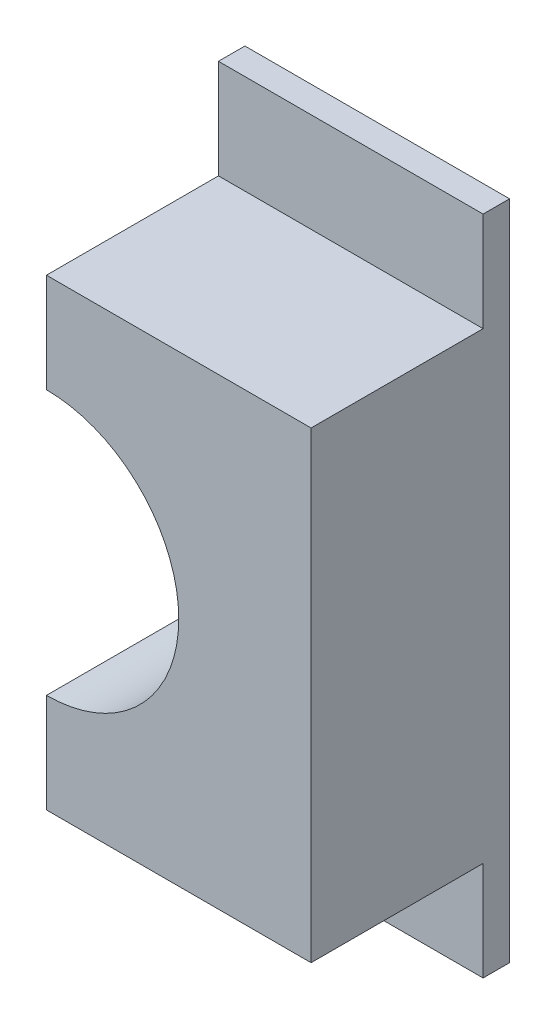
ISO-10303-21;
HEADER;
FILE_DESCRIPTION(('STEP AP214'),'2;1');
FILE_NAME('part.step','',(''),(''),'','','');
FILE_SCHEMA(('AUTOMOTIVE_DESIGN { 1 0 10303 214 1 1 1 1 }'));
ENDSEC;
DATA;
#1=APPLICATION_CONTEXT('core data for automotive mechanical design processes');
#2=APPLICATION_PROTOCOL_DEFINITION('international standard','automotive_design',2000,#1);
#3=PRODUCT_CONTEXT('',#1,'mechanical');
#4=PRODUCT('Part','Part','',(#3));
#5=PRODUCT_RELATED_PRODUCT_CATEGORY('part','',(#4));
#6=PRODUCT_DEFINITION_FORMATION('','',#4);
#7=PRODUCT_DEFINITION_CONTEXT('part definition',#1,'design');
#8=PRODUCT_DEFINITION('design','',#6,#7);
#9=PRODUCT_DEFINITION_SHAPE('','',#8);
#10=(LENGTH_UNIT() NAMED_UNIT(*) SI_UNIT(.MILLI.,.METRE.));
#11=(NAMED_UNIT(*) PLANE_ANGLE_UNIT() SI_UNIT($,.RADIAN.));
#12=(NAMED_UNIT(*) SI_UNIT($,.STERADIAN.) SOLID_ANGLE_UNIT());
#13=UNCERTAINTY_MEASURE_WITH_UNIT(LENGTH_MEASURE(1.E-05),#10,'distance_accuracy_value','');
#14=(GEOMETRIC_REPRESENTATION_CONTEXT(3) GLOBAL_UNCERTAINTY_ASSIGNED_CONTEXT((#13)) GLOBAL_UNIT_ASSIGNED_CONTEXT((#10,
#11,#12)) REPRESENTATION_CONTEXT('',''));
#15=CARTESIAN_POINT('',(0.,0.,0.));
#16=DIRECTION('',(0.,0.,1.));
#17=DIRECTION('',(1.,0.,0.));
#18=AXIS2_PLACEMENT_3D('',#15,#16,#17);
#19=CARTESIAN_POINT('',(-0.2,-0.5,0.04));
#20=DIRECTION('',(0.,0.,1.));
#21=DIRECTION('',(1.,0.,0.));
#22=AXIS2_PLACEMENT_3D('',#19,#20,#21);
#23=PLANE('',#22);
#24=DIRECTION('',(1.,0.,0.));
#25=VECTOR('',#24,1.);
#26=CARTESIAN_POINT('',(0.2,0.5,0.04));
#27=LINE('',#26,#25);
#28=CARTESIAN_POINT('',(0.2,0.5,0.04));
#29=VERTEX_POINT('',#28);
#30=CARTESIAN_POINT('',(-0.2,0.5,0.04));
#31=VERTEX_POINT('',#30);
#32=EDGE_CURVE('E157',#29,#31,#27,.F.);
#33=ORIENTED_EDGE('',*,*,#32,.T.);
#34=DIRECTION('',(0.,1.,0.));
#35=VECTOR('',#34,1.);
#36=CARTESIAN_POINT('',(-0.2,0.35,0.04));
#37=LINE('',#36,#35);
#38=CARTESIAN_POINT('',(-0.2,0.35,0.04));
#39=VERTEX_POINT('',#38);
#40=EDGE_CURVE('E147',#31,#39,#37,.F.);
#41=ORIENTED_EDGE('',*,*,#40,.T.);
#42=DIRECTION('',(1.,0.,0.));
#43=VECTOR('',#42,1.);
#44=CARTESIAN_POINT('',(0.2,0.35,0.04));
#45=LINE('',#44,#43);
#46=CARTESIAN_POINT('',(0.2,0.35,0.04));
#47=VERTEX_POINT('',#46);
#48=EDGE_CURVE('E81',#39,#47,#45,.T.);
#49=ORIENTED_EDGE('',*,*,#48,.T.);
#50=DIRECTION('',(0.,1.,0.));
#51=VECTOR('',#50,1.);
#52=CARTESIAN_POINT('',(0.2,-0.35,0.04));
#53=LINE('',#52,#51);
#54=EDGE_CURVE('E162',#47,#29,#53,.T.);
#55=ORIENTED_EDGE('',*,*,#54,.T.);
#56=EDGE_LOOP('',(#33,#41,#49,#55));
#57=FACE_BOUND('',#56,.T.);
#58=ADVANCED_FACE('F17',(#57),#23,.T.);
#59=CARTESIAN_POINT('',(0.2,0.35,0.3));
#60=DIRECTION('',(0.,-1.,0.));
#61=DIRECTION('',(0.,0.,-1.));
#62=AXIS2_PLACEMENT_3D('',#59,#60,#61);
#63=PLANE('',#62);
#64=ORIENTED_EDGE('',*,*,#48,.F.);
#65=DIRECTION('',(0.,0.,-1.));
#66=VECTOR('',#65,1.);
#67=CARTESIAN_POINT('',(-0.2,0.35,0.3));
#68=LINE('',#67,#66);
#69=CARTESIAN_POINT('',(-0.2,0.35,0.3));
#70=VERTEX_POINT('',#69);
#71=EDGE_CURVE('E139',#39,#70,#68,.F.);
#72=ORIENTED_EDGE('',*,*,#71,.T.);
#73=DIRECTION('',(1.,0.,0.));
#74=VECTOR('',#73,1.);
#75=CARTESIAN_POINT('',(-0.2,0.35,0.3));
#76=LINE('',#75,#74);
#77=CARTESIAN_POINT('',(0.2,0.35,0.3));
#78=VERTEX_POINT('',#77);
#79=EDGE_CURVE('E57',#78,#70,#76,.F.);
#80=ORIENTED_EDGE('',*,*,#79,.F.);
#81=DIRECTION('',(0.,0.,1.));
#82=VECTOR('',#81,1.);
#83=CARTESIAN_POINT('',(0.2,0.35,0.3));
#84=LINE('',#83,#82);
#85=EDGE_CURVE('E164',#78,#47,#84,.F.);
#86=ORIENTED_EDGE('',*,*,#85,.T.);
#87=EDGE_LOOP('',(#64,#72,#80,#86));
#88=FACE_BOUND('',#87,.T.);
#89=ADVANCED_FACE('F246',(#88),#63,.F.);
#90=CARTESIAN_POINT('',(-0.2,-0.35,0.3));
#91=DIRECTION('',(0.,1.,0.));
#92=DIRECTION('',(0.,0.,1.));
#93=AXIS2_PLACEMENT_3D('',#90,#91,#92);
#94=PLANE('',#93);
#95=DIRECTION('',(1.,0.,0.));
#96=VECTOR('',#95,1.);
#97=CARTESIAN_POINT('',(-0.2,-0.35,0.04));
#98=LINE('',#97,#96);
#99=CARTESIAN_POINT('',(0.2,-0.35,0.04));
#100=VERTEX_POINT('',#99);
#101=CARTESIAN_POINT('',(-0.2,-0.35,0.04));
#102=VERTEX_POINT('',#101);
#103=EDGE_CURVE('E124',#100,#102,#98,.F.);
#104=ORIENTED_EDGE('',*,*,#103,.F.);
#105=DIRECTION('',(0.,0.,1.));
#106=VECTOR('',#105,1.);
#107=CARTESIAN_POINT('',(0.2,-0.35,0.3));
#108=LINE('',#107,#106);
#109=CARTESIAN_POINT('',(0.2,-0.35,0.3));
#110=VERTEX_POINT('',#109);
#111=EDGE_CURVE('E169',#100,#110,#108,.T.);
#112=ORIENTED_EDGE('',*,*,#111,.T.);
#113=DIRECTION('',(1.,0.,0.));
#114=VECTOR('',#113,1.);
#115=CARTESIAN_POINT('',(-0.2,-0.35,0.3));
#116=LINE('',#115,#114);
#117=CARTESIAN_POINT('',(-0.2,-0.35,0.3));
#118=VERTEX_POINT('',#117);
#119=EDGE_CURVE('E134',#118,#110,#116,.T.);
#120=ORIENTED_EDGE('',*,*,#119,.F.);
#121=DIRECTION('',(0.,0.,-1.));
#122=VECTOR('',#121,1.);
#123=CARTESIAN_POINT('',(-0.2,-0.35,0.3));
#124=LINE('',#123,#122);
#125=EDGE_CURVE('E125',#118,#102,#124,.T.);
#126=ORIENTED_EDGE('',*,*,#125,.T.);
#127=EDGE_LOOP('',(#104,#112,#120,#126));
#128=FACE_BOUND('',#127,.T.);
#129=ADVANCED_FACE('F240',(#128),#94,.F.);
#130=CARTESIAN_POINT('',(-0.2,-0.5,0.04));
#131=DIRECTION('',(0.,0.,1.));
#132=DIRECTION('',(1.,0.,0.));
#133=AXIS2_PLACEMENT_3D('',#130,#131,#132);
#134=PLANE('',#133);
#135=DIRECTION('',(1.,0.,0.));
#136=VECTOR('',#135,1.);
#137=CARTESIAN_POINT('',(-0.2,-0.5,0.04));
#138=LINE('',#137,#136);
#139=CARTESIAN_POINT('',(-0.2,-0.5,0.04));
#140=VERTEX_POINT('',#139);
#141=CARTESIAN_POINT('',(0.2,-0.5,0.04));
#142=VERTEX_POINT('',#141);
#143=EDGE_CURVE('E88',#140,#142,#138,.T.);
#144=ORIENTED_EDGE('',*,*,#143,.T.);
#145=DIRECTION('',(0.,1.,0.));
#146=VECTOR('',#145,1.);
#147=CARTESIAN_POINT('',(0.2,-0.35,0.04));
#148=LINE('',#147,#146);
#149=EDGE_CURVE('E167',#142,#100,#148,.T.);
#150=ORIENTED_EDGE('',*,*,#149,.T.);
#151=ORIENTED_EDGE('',*,*,#103,.T.);
#152=DIRECTION('',(0.,1.,0.));
#153=VECTOR('',#152,1.);
#154=CARTESIAN_POINT('',(-0.2,0.35,0.04));
#155=LINE('',#154,#153);
#156=EDGE_CURVE('E120',#102,#140,#155,.F.);
#157=ORIENTED_EDGE('',*,*,#156,.T.);
#158=EDGE_LOOP('',(#144,#150,#151,#157));
#159=FACE_BOUND('',#158,.T.);
#160=ADVANCED_FACE('F123',(#159),#134,.T.);
#161=CARTESIAN_POINT('',(-0.2,-0.35,0.3));
#162=DIRECTION('',(0.,0.,1.));
#163=DIRECTION('',(1.,0.,0.));
#164=AXIS2_PLACEMENT_3D('',#161,#162,#163);
#165=PLANE('',#164);
#166=ORIENTED_EDGE('',*,*,#79,.T.);
#167=DIRECTION('',(0.,1.,0.));
#168=VECTOR('',#167,1.);
#169=CARTESIAN_POINT('',(-0.2,0.35,0.3));
#170=LINE('',#169,#168);
#171=CARTESIAN_POINT('',(-0.2,0.2,0.3));
#172=VERTEX_POINT('',#171);
#173=EDGE_CURVE('E48',#70,#172,#170,.F.);
#174=ORIENTED_EDGE('',*,*,#173,.T.);
#175=CARTESIAN_POINT('',(-0.2,0.,0.3));
#176=DIRECTION('',(0.,0.,1.));
#177=DIRECTION('',(1.,0.,0.));
#178=AXIS2_PLACEMENT_3D('',#175,#176,#177);
#179=CIRCLE('',#178,0.2);
#180=CARTESIAN_POINT('',(-0.2,-0.2,0.3));
#181=VERTEX_POINT('',#180);
#182=EDGE_CURVE('E20',#172,#181,#179,.F.);
#183=ORIENTED_EDGE('',*,*,#182,.T.);
#184=DIRECTION('',(0.,1.,0.));
#185=VECTOR('',#184,1.);
#186=CARTESIAN_POINT('',(-0.2,0.35,0.3));
#187=LINE('',#186,#185);
#188=EDGE_CURVE('E200',#181,#118,#187,.F.);
#189=ORIENTED_EDGE('',*,*,#188,.T.);
#190=ORIENTED_EDGE('',*,*,#119,.T.);
#191=DIRECTION('',(0.,1.,0.));
#192=VECTOR('',#191,1.);
#193=CARTESIAN_POINT('',(0.2,-0.35,0.3));
#194=LINE('',#193,#192);
#195=EDGE_CURVE('E116',#110,#78,#194,.T.);
#196=ORIENTED_EDGE('',*,*,#195,.T.);
#197=EDGE_LOOP('',(#166,#174,#183,#189,#190,#196));
#198=FACE_BOUND('',#197,.T.);
#199=ADVANCED_FACE('F234',(#198),#165,.T.);
#200=CARTESIAN_POINT('',(-0.2,-0.5,0.04));
#201=DIRECTION('',(0.,1.,0.));
#202=DIRECTION('',(0.,0.,1.));
#203=AXIS2_PLACEMENT_3D('',#200,#201,#202);
#204=PLANE('',#203);
#205=DIRECTION('',(0.,0.,1.));
#206=VECTOR('',#205,1.);
#207=CARTESIAN_POINT('',(0.2,-0.5,0.3));
#208=LINE('',#207,#206);
#209=CARTESIAN_POINT('',(0.2,-0.5,0.));
#210=VERTEX_POINT('',#209);
#211=EDGE_CURVE('E115',#210,#142,#208,.T.);
#212=ORIENTED_EDGE('',*,*,#211,.T.);
#213=ORIENTED_EDGE('',*,*,#143,.F.);
#214=DIRECTION('',(0.,0.,-1.));
#215=VECTOR('',#214,1.);
#216=CARTESIAN_POINT('',(-0.2,-0.5,0.3));
#217=LINE('',#216,#215);
#218=CARTESIAN_POINT('',(-0.2,-0.5,0.));
#219=VERTEX_POINT('',#218);
#220=EDGE_CURVE('E114',#140,#219,#217,.T.);
#221=ORIENTED_EDGE('',*,*,#220,.T.);
#222=DIRECTION('',(1.,0.,0.));
#223=VECTOR('',#222,1.);
#224=CARTESIAN_POINT('',(-0.2,-0.5,0.));
#225=LINE('',#224,#223);
#226=EDGE_CURVE('E107',#219,#210,#225,.T.);
#227=ORIENTED_EDGE('',*,*,#226,.T.);
#228=EDGE_LOOP('',(#212,#213,#221,#227));
#229=FACE_BOUND('',#228,.T.);
#230=ADVANCED_FACE('F113',(#229),#204,.F.);
#231=CARTESIAN_POINT('',(0.2,-0.35,0.3));
#232=DIRECTION('',(-1.,0.,0.));
#233=DIRECTION('',(0.,0.,1.));
#234=AXIS2_PLACEMENT_3D('',#231,#232,#233);
#235=PLANE('',#234);
#236=ORIENTED_EDGE('',*,*,#149,.F.);
#237=ORIENTED_EDGE('',*,*,#211,.F.);
#238=DIRECTION('',(0.,1.,0.));
#239=VECTOR('',#238,1.);
#240=CARTESIAN_POINT('',(0.2,-0.35,0.));
#241=LINE('',#240,#239);
#242=CARTESIAN_POINT('',(0.2,0.5,0.));
#243=VERTEX_POINT('',#242);
#244=EDGE_CURVE('E193',#210,#243,#241,.T.);
#245=ORIENTED_EDGE('',*,*,#244,.T.);
#246=DIRECTION('',(0.,0.,-1.));
#247=VECTOR('',#246,1.);
#248=CARTESIAN_POINT('',(0.2,0.5,0.04));
#249=LINE('',#248,#247);
#250=EDGE_CURVE('E159',#243,#29,#249,.F.);
#251=ORIENTED_EDGE('',*,*,#250,.T.);
#252=ORIENTED_EDGE('',*,*,#54,.F.);
#253=ORIENTED_EDGE('',*,*,#85,.F.);
#254=ORIENTED_EDGE('',*,*,#195,.F.);
#255=ORIENTED_EDGE('',*,*,#111,.F.);
#256=EDGE_LOOP('',(#236,#237,#245,#251,#252,#253,#254,#255));
#257=FACE_BOUND('',#256,.T.);
#258=ADVANCED_FACE('F239',(#257),#235,.F.);
#259=CARTESIAN_POINT('',(0.2,0.5,0.04));
#260=DIRECTION('',(0.,-1.,0.));
#261=DIRECTION('',(0.,0.,-1.));
#262=AXIS2_PLACEMENT_3D('',#259,#260,#261);
#263=PLANE('',#262);
#264=DIRECTION('',(0.,0.,-1.));
#265=VECTOR('',#264,1.);
#266=CARTESIAN_POINT('',(-0.2,0.5,0.3));
#267=LINE('',#266,#265);
#268=CARTESIAN_POINT('',(-0.2,0.5,0.));
#269=VERTEX_POINT('',#268);
#270=EDGE_CURVE('E154',#269,#31,#267,.F.);
#271=ORIENTED_EDGE('',*,*,#270,.T.);
#272=ORIENTED_EDGE('',*,*,#32,.F.);
#273=ORIENTED_EDGE('',*,*,#250,.F.);
#274=DIRECTION('',(1.,0.,0.));
#275=VECTOR('',#274,1.);
#276=CARTESIAN_POINT('',(-0.2,0.5,0.));
#277=LINE('',#276,#275);
#278=EDGE_CURVE('E187',#243,#269,#277,.F.);
#279=ORIENTED_EDGE('',*,*,#278,.T.);
#280=EDGE_LOOP('',(#271,#272,#273,#279));
#281=FACE_BOUND('',#280,.T.);
#282=ADVANCED_FACE('F266',(#281),#263,.F.);
#283=CARTESIAN_POINT('',(-0.2,0.35,0.3));
#284=DIRECTION('',(1.,0.,0.));
#285=DIRECTION('',(0.,0.,-1.));
#286=AXIS2_PLACEMENT_3D('',#283,#284,#285);
#287=PLANE('',#286);
#288=DIRECTION('',(0.,0.,1.));
#289=VECTOR('',#288,1.);
#290=CARTESIAN_POINT('',(-0.2,0.2,1.204159457879));
#291=LINE('',#290,#289);
#292=CARTESIAN_POINT('',(-0.2,0.2,0.));
#293=VERTEX_POINT('',#292);
#294=EDGE_CURVE('E138',#293,#172,#291,.T.);
#295=ORIENTED_EDGE('',*,*,#294,.T.);
#296=ORIENTED_EDGE('',*,*,#173,.F.);
#297=ORIENTED_EDGE('',*,*,#71,.F.);
#298=ORIENTED_EDGE('',*,*,#40,.F.);
#299=ORIENTED_EDGE('',*,*,#270,.F.);
#300=DIRECTION('',(0.,1.,0.));
#301=VECTOR('',#300,1.);
#302=CARTESIAN_POINT('',(-0.2,-0.35,0.));
#303=LINE('',#302,#301);
#304=EDGE_CURVE('E183',#269,#293,#303,.F.);
#305=ORIENTED_EDGE('',*,*,#304,.T.);
#306=EDGE_LOOP('',(#295,#296,#297,#298,#299,#305));
#307=FACE_BOUND('',#306,.T.);
#308=ADVANCED_FACE('F242',(#307),#287,.F.);
#309=CARTESIAN_POINT('',(-0.2,0.,1.204159457879));
#310=DIRECTION('',(0.,0.,1.));
#311=DIRECTION('',(1.,0.,0.));
#312=AXIS2_PLACEMENT_3D('',#309,#310,#311);
#313=CYLINDRICAL_SURFACE('',#312,0.2);
#314=ORIENTED_EDGE('',*,*,#294,.F.);
#315=CARTESIAN_POINT('',(-0.2,0.,0.));
#316=DIRECTION('',(0.,0.,1.));
#317=DIRECTION('',(1.,0.,0.));
#318=AXIS2_PLACEMENT_3D('',#315,#316,#317);
#319=CIRCLE('',#318,0.2);
#320=CARTESIAN_POINT('',(-0.2,-0.2,0.));
#321=VERTEX_POINT('',#320);
#322=EDGE_CURVE('E26',#293,#321,#319,.F.);
#323=ORIENTED_EDGE('',*,*,#322,.T.);
#324=DIRECTION('',(0.,0.,-1.));
#325=VECTOR('',#324,1.);
#326=CARTESIAN_POINT('',(-0.2,-0.2,0.3));
#327=LINE('',#326,#325);
#328=EDGE_CURVE('E34',#321,#181,#327,.F.);
#329=ORIENTED_EDGE('',*,*,#328,.T.);
#330=ORIENTED_EDGE('',*,*,#182,.F.);
#331=EDGE_LOOP('',(#314,#323,#329,#330));
#332=FACE_BOUND('',#331,.T.);
#333=ADVANCED_FACE('F241',(#332),#313,.F.);
#334=CARTESIAN_POINT('',(-0.2,0.35,0.3));
#335=DIRECTION('',(1.,0.,0.));
#336=DIRECTION('',(0.,0.,-1.));
#337=AXIS2_PLACEMENT_3D('',#334,#335,#336);
#338=PLANE('',#337);
#339=ORIENTED_EDGE('',*,*,#328,.F.);
#340=DIRECTION('',(0.,1.,0.));
#341=VECTOR('',#340,1.);
#342=CARTESIAN_POINT('',(-0.2,-0.35,0.));
#343=LINE('',#342,#341);
#344=EDGE_CURVE('E11',#321,#219,#343,.F.);
#345=ORIENTED_EDGE('',*,*,#344,.T.);
#346=ORIENTED_EDGE('',*,*,#220,.F.);
#347=ORIENTED_EDGE('',*,*,#156,.F.);
#348=ORIENTED_EDGE('',*,*,#125,.F.);
#349=ORIENTED_EDGE('',*,*,#188,.F.);
#350=EDGE_LOOP('',(#339,#345,#346,#347,#348,#349));
#351=FACE_BOUND('',#350,.T.);
#352=ADVANCED_FACE('F119',(#351),#338,.F.);
#353=CARTESIAN_POINT('',(-0.2,-0.35,0.));
#354=DIRECTION('',(0.,0.,1.));
#355=DIRECTION('',(1.,0.,0.));
#356=AXIS2_PLACEMENT_3D('',#353,#354,#355);
#357=PLANE('',#356);
#358=ORIENTED_EDGE('',*,*,#322,.F.);
#359=ORIENTED_EDGE('',*,*,#304,.F.);
#360=ORIENTED_EDGE('',*,*,#278,.F.);
#361=ORIENTED_EDGE('',*,*,#244,.F.);
#362=ORIENTED_EDGE('',*,*,#226,.F.);
#363=ORIENTED_EDGE('',*,*,#344,.F.);
#364=EDGE_LOOP('',(#358,#359,#360,#361,#362,#363));
#365=FACE_BOUND('',#364,.T.);
#366=ADVANCED_FACE('F254',(#365),#357,.F.);
#367=CLOSED_SHELL('',(#58,#89,#129,#160,#199,#230,#258,#282,#308,#333,#352,#366));
#368=MANIFOLD_SOLID_BREP('B1',#367);
#369=ADVANCED_BREP_SHAPE_REPRESENTATION('',(#18,#368),#14);
#370=SHAPE_DEFINITION_REPRESENTATION(#9,#369);
ENDSEC;
END-ISO-10303-21;
